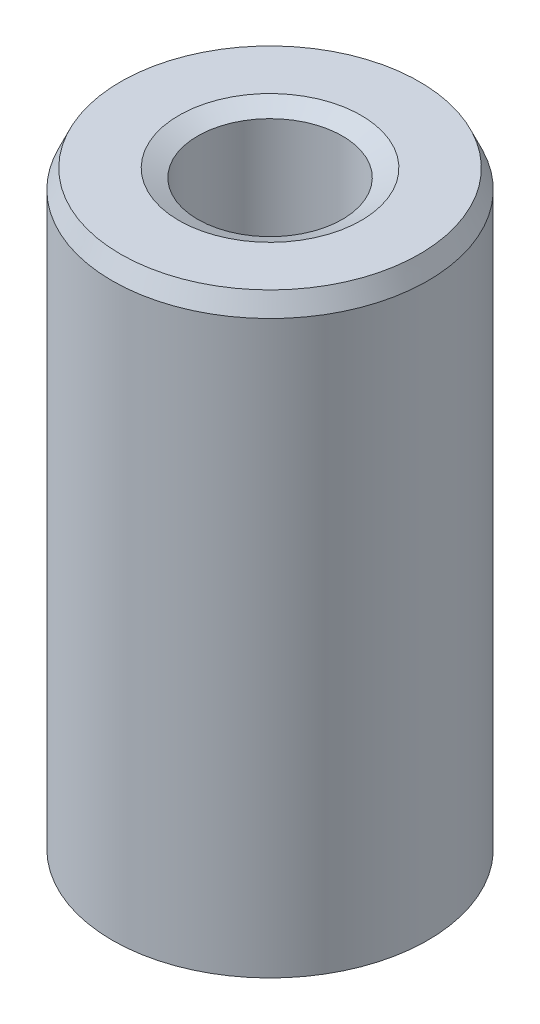
ISO-10303-21;
HEADER;
FILE_DESCRIPTION(('STEP AP214'),'2;1');
FILE_NAME('part.step','',(''),(''),'','','');
FILE_SCHEMA(('AUTOMOTIVE_DESIGN { 1 0 10303 214 1 1 1 1 }'));
ENDSEC;
DATA;
#1=APPLICATION_CONTEXT('core data for automotive mechanical design processes');
#2=APPLICATION_PROTOCOL_DEFINITION('international standard','automotive_design',2000,#1);
#3=PRODUCT_CONTEXT('',#1,'mechanical');
#4=PRODUCT('Part','Part','',(#3));
#5=PRODUCT_RELATED_PRODUCT_CATEGORY('part','',(#4));
#6=PRODUCT_DEFINITION_FORMATION('','',#4);
#7=PRODUCT_DEFINITION_CONTEXT('part definition',#1,'design');
#8=PRODUCT_DEFINITION('design','',#6,#7);
#9=PRODUCT_DEFINITION_SHAPE('','',#8);
#10=(LENGTH_UNIT() NAMED_UNIT(*) SI_UNIT(.MILLI.,.METRE.));
#11=(NAMED_UNIT(*) PLANE_ANGLE_UNIT() SI_UNIT($,.RADIAN.));
#12=(NAMED_UNIT(*) SI_UNIT($,.STERADIAN.) SOLID_ANGLE_UNIT());
#13=UNCERTAINTY_MEASURE_WITH_UNIT(LENGTH_MEASURE(1.E-05),#10,'distance_accuracy_value','');
#14=(GEOMETRIC_REPRESENTATION_CONTEXT(3) GLOBAL_UNCERTAINTY_ASSIGNED_CONTEXT((#13)) GLOBAL_UNIT_ASSIGNED_CONTEXT((#10,
#11,#12)) REPRESENTATION_CONTEXT('',''));
#15=CARTESIAN_POINT('',(0.,0.,0.));
#16=DIRECTION('',(0.,0.,1.));
#17=DIRECTION('',(1.,0.,0.));
#18=AXIS2_PLACEMENT_3D('',#15,#16,#17);
#19=CARTESIAN_POINT('',(0.,47.3826351830874,0.));
#20=DIRECTION('',(0.,-1.,0.));
#21=DIRECTION('',(0.,0.,-1.));
#22=AXIS2_PLACEMENT_3D('',#19,#20,#21);
#23=CYLINDRICAL_SURFACE('',#22,12.5);
#24=CARTESIAN_POINT('',(0.,0.666853230673566,0.));
#25=DIRECTION('',(0.,1.,0.));
#26=DIRECTION('',(0.,0.,1.));
#27=AXIS2_PLACEMENT_3D('',#24,#25,#26);
#28=CIRCLE('',#27,12.5);
#29=CARTESIAN_POINT('',(0.,0.666853230673566,12.5));
#30=VERTEX_POINT('',#29);
#31=EDGE_CURVE('E10',#30,#30,#28,.T.);
#32=ORIENTED_EDGE('',*,*,#31,.T.);
#33=EDGE_LOOP('',(#32));
#34=FACE_BOUND('',#33,.T.);
#35=CARTESIAN_POINT('',(0.,45.8918971014642,0.));
#36=DIRECTION('',(0.,1.,0.));
#37=DIRECTION('',(0.,0.,1.));
#38=AXIS2_PLACEMENT_3D('',#35,#36,#37);
#39=CIRCLE('',#38,12.5);
#40=CARTESIAN_POINT('',(0.,45.8918971014642,12.5));
#41=VERTEX_POINT('',#40);
#42=EDGE_CURVE('E50',#41,#41,#39,.F.);
#43=ORIENTED_EDGE('',*,*,#42,.T.);
#44=EDGE_LOOP('',(#43));
#45=FACE_BOUND('',#44,.T.);
#46=ADVANCED_FACE('F39',(#34,#45),#23,.T.);
#47=CARTESIAN_POINT('',(0.,47.3826351830874,0.));
#48=DIRECTION('',(0.,1.,0.));
#49=DIRECTION('',(0.,0.,1.));
#50=AXIS2_PLACEMENT_3D('',#47,#48,#49);
#51=PLANE('',#50);
#52=CARTESIAN_POINT('',(0.,47.3826351830874,0.));
#53=DIRECTION('',(0.,1.,0.));
#54=DIRECTION('',(0.,0.,1.));
#55=AXIS2_PLACEMENT_3D('',#52,#53,#54);
#56=CIRCLE('',#55,7.21696807593605);
#57=CARTESIAN_POINT('',(0.,47.3826351830874,7.21696807593605));
#58=VERTEX_POINT('',#57);
#59=EDGE_CURVE('E58',#58,#58,#56,.F.);
#60=ORIENTED_EDGE('',*,*,#59,.T.);
#61=EDGE_LOOP('',(#60));
#62=FACE_BOUND('',#61,.T.);
#63=CARTESIAN_POINT('',(0.,47.3826351830874,0.));
#64=DIRECTION('',(0.,1.,0.));
#65=DIRECTION('',(0.,0.,1.));
#66=AXIS2_PLACEMENT_3D('',#63,#64,#65);
#67=CIRCLE('',#66,11.8331467693264);
#68=CARTESIAN_POINT('',(0.,47.3826351830874,11.8331467693264));
#69=VERTEX_POINT('',#68);
#70=EDGE_CURVE('E61',#69,#69,#67,.T.);
#71=ORIENTED_EDGE('',*,*,#70,.T.);
#72=EDGE_LOOP('',(#71));
#73=FACE_BOUND('',#72,.T.);
#74=ADVANCED_FACE('F88',(#62,#73),#51,.T.);
#75=CARTESIAN_POINT('',(0.,0.,0.));
#76=DIRECTION('',(0.,1.,0.));
#77=DIRECTION('',(0.,0.,1.));
#78=AXIS2_PLACEMENT_3D('',#75,#76,#77);
#79=PLANE('',#78);
#80=CARTESIAN_POINT('',(0.,0.,0.));
#81=DIRECTION('',(0.,1.,0.));
#82=DIRECTION('',(0.,0.,1.));
#83=AXIS2_PLACEMENT_3D('',#80,#81,#82);
#84=CIRCLE('',#83,6.39308322498631);
#85=CARTESIAN_POINT('',(0.,0.,6.39308322498631));
#86=VERTEX_POINT('',#85);
#87=EDGE_CURVE('E51',#86,#86,#84,.T.);
#88=ORIENTED_EDGE('',*,*,#87,.T.);
#89=EDGE_LOOP('',(#88));
#90=FACE_BOUND('',#89,.T.);
#91=CARTESIAN_POINT('',(0.,0.,0.));
#92=DIRECTION('',(0.,1.,0.));
#93=DIRECTION('',(0.,0.,1.));
#94=AXIS2_PLACEMENT_3D('',#91,#92,#93);
#95=CIRCLE('',#94,11.0092619183767);
#96=CARTESIAN_POINT('',(0.,0.,11.0092619183767));
#97=VERTEX_POINT('',#96);
#98=EDGE_CURVE('E54',#97,#97,#95,.F.);
#99=ORIENTED_EDGE('',*,*,#98,.T.);
#100=EDGE_LOOP('',(#99));
#101=FACE_BOUND('',#100,.T.);
#102=ADVANCED_FACE('F83',(#90,#101),#79,.F.);
#103=CARTESIAN_POINT('',(0.,47.3826351830874,0.));
#104=DIRECTION('',(0.,-1.,0.));
#105=DIRECTION('',(0.,0.,-1.));
#106=AXIS2_PLACEMENT_3D('',#103,#104,#105);
#107=CYLINDRICAL_SURFACE('',#106,5.72622999431275);
#108=CARTESIAN_POINT('',(0.,46.7157819524139,0.));
#109=DIRECTION('',(0.,1.,0.));
#110=DIRECTION('',(0.,0.,1.));
#111=AXIS2_PLACEMENT_3D('',#108,#109,#110);
#112=CIRCLE('',#111,5.72622999431275);
#113=CARTESIAN_POINT('',(0.,46.7157819524139,5.72622999431275));
#114=VERTEX_POINT('',#113);
#115=EDGE_CURVE('E67',#114,#114,#112,.T.);
#116=ORIENTED_EDGE('',*,*,#115,.T.);
#117=EDGE_LOOP('',(#116));
#118=FACE_BOUND('',#117,.T.);
#119=CARTESIAN_POINT('',(0.,1.49073808162329,0.));
#120=DIRECTION('',(0.,1.,0.));
#121=DIRECTION('',(0.,0.,1.));
#122=AXIS2_PLACEMENT_3D('',#119,#120,#121);
#123=CIRCLE('',#122,5.72622999431275);
#124=CARTESIAN_POINT('',(0.,1.49073808162329,5.72622999431275));
#125=VERTEX_POINT('',#124);
#126=EDGE_CURVE('E69',#125,#125,#123,.F.);
#127=ORIENTED_EDGE('',*,*,#126,.T.);
#128=EDGE_LOOP('',(#127));
#129=FACE_BOUND('',#128,.T.);
#130=ADVANCED_FACE('F71',(#118,#129),#107,.F.);
#131=CARTESIAN_POINT('',(0.,46.7157819524139,0.));
#132=DIRECTION('',(0.,1.,0.));
#133=DIRECTION('',(0.,0.,1.));
#134=AXIS2_PLACEMENT_3D('',#131,#132,#133);
#135=CONICAL_SURFACE('',#134,5.72622999431275,1.15016422920264);
#136=ORIENTED_EDGE('',*,*,#59,.F.);
#137=EDGE_LOOP('',(#136));
#138=FACE_BOUND('',#137,.T.);
#139=ORIENTED_EDGE('',*,*,#115,.F.);
#140=EDGE_LOOP('',(#139));
#141=FACE_BOUND('',#140,.T.);
#142=ADVANCED_FACE('F77',(#138,#141),#135,.F.);
#143=CARTESIAN_POINT('',(0.,0.,0.));
#144=DIRECTION('',(0.,-1.,0.));
#145=DIRECTION('',(0.,0.,-1.));
#146=AXIS2_PLACEMENT_3D('',#143,#144,#145);
#147=CONICAL_SURFACE('',#146,6.39308322498631,0.420632097592257);
#148=ORIENTED_EDGE('',*,*,#126,.F.);
#149=EDGE_LOOP('',(#148));
#150=FACE_BOUND('',#149,.T.);
#151=ORIENTED_EDGE('',*,*,#87,.F.);
#152=EDGE_LOOP('',(#151));
#153=FACE_BOUND('',#152,.T.);
#154=ADVANCED_FACE('F73',(#150,#153),#147,.F.);
#155=CARTESIAN_POINT('',(0.,0.666853230673566,0.));
#156=DIRECTION('',(0.,1.,0.));
#157=DIRECTION('',(0.,0.,1.));
#158=AXIS2_PLACEMENT_3D('',#155,#156,#157);
#159=CONICAL_SURFACE('',#158,12.5,1.15016422920264);
#160=ORIENTED_EDGE('',*,*,#98,.F.);
#161=EDGE_LOOP('',(#160));
#162=FACE_BOUND('',#161,.T.);
#163=ORIENTED_EDGE('',*,*,#31,.F.);
#164=EDGE_LOOP('',(#163));
#165=FACE_BOUND('',#164,.T.);
#166=ADVANCED_FACE('F76',(#162,#165),#159,.T.);
#167=CARTESIAN_POINT('',(0.,47.3826351830874,0.));
#168=DIRECTION('',(0.,-1.,0.));
#169=DIRECTION('',(0.,0.,-1.));
#170=AXIS2_PLACEMENT_3D('',#167,#168,#169);
#171=CONICAL_SURFACE('',#170,11.8331467693264,0.420632097592256);
#172=ORIENTED_EDGE('',*,*,#42,.F.);
#173=EDGE_LOOP('',(#172));
#174=FACE_BOUND('',#173,.T.);
#175=ORIENTED_EDGE('',*,*,#70,.F.);
#176=EDGE_LOOP('',(#175));
#177=FACE_BOUND('',#176,.T.);
#178=ADVANCED_FACE('F45',(#174,#177),#171,.T.);
#179=CLOSED_SHELL('',(#46,#74,#102,#130,#142,#154,#166,#178));
#180=MANIFOLD_SOLID_BREP('B2',#179);
#181=ADVANCED_BREP_SHAPE_REPRESENTATION('',(#18,#180),#14);
#182=SHAPE_DEFINITION_REPRESENTATION(#9,#181);
ENDSEC;
END-ISO-10303-21;
